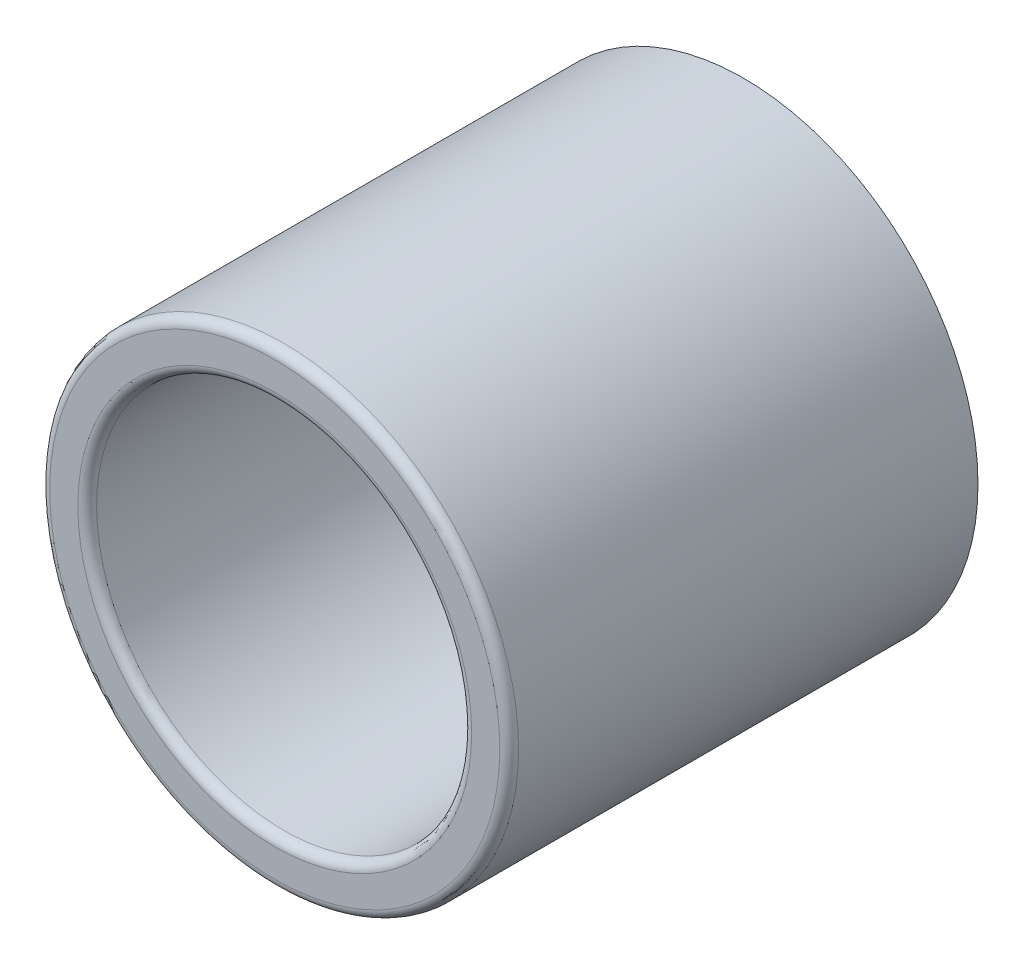
ISO-10303-21;
HEADER;
FILE_DESCRIPTION(('STEP AP214'),'2;1');
FILE_NAME('part.step','',(''),(''),'','','');
FILE_SCHEMA(('AUTOMOTIVE_DESIGN { 1 0 10303 214 1 1 1 1 }'));
ENDSEC;
DATA;
#1=APPLICATION_CONTEXT('core data for automotive mechanical design processes');
#2=APPLICATION_PROTOCOL_DEFINITION('international standard','automotive_design',2000,#1);
#3=PRODUCT_CONTEXT('',#1,'mechanical');
#4=PRODUCT('Part','Part','',(#3));
#5=PRODUCT_RELATED_PRODUCT_CATEGORY('part','',(#4));
#6=PRODUCT_DEFINITION_FORMATION('','',#4);
#7=PRODUCT_DEFINITION_CONTEXT('part definition',#1,'design');
#8=PRODUCT_DEFINITION('design','',#6,#7);
#9=PRODUCT_DEFINITION_SHAPE('','',#8);
#10=(LENGTH_UNIT() NAMED_UNIT(*) SI_UNIT(.MILLI.,.METRE.));
#11=(NAMED_UNIT(*) PLANE_ANGLE_UNIT() SI_UNIT($,.RADIAN.));
#12=(NAMED_UNIT(*) SI_UNIT($,.STERADIAN.) SOLID_ANGLE_UNIT());
#13=UNCERTAINTY_MEASURE_WITH_UNIT(LENGTH_MEASURE(1.E-05),#10,'distance_accuracy_value','');
#14=(GEOMETRIC_REPRESENTATION_CONTEXT(3) GLOBAL_UNCERTAINTY_ASSIGNED_CONTEXT((#13)) GLOBAL_UNIT_ASSIGNED_CONTEXT((#10,
#11,#12)) REPRESENTATION_CONTEXT('',''));
#15=CARTESIAN_POINT('',(0.,0.,0.));
#16=DIRECTION('',(0.,0.,1.));
#17=DIRECTION('',(1.,0.,0.));
#18=AXIS2_PLACEMENT_3D('',#15,#16,#17);
#19=CARTESIAN_POINT('',(0.,0.,5.));
#20=DIRECTION('',(0.,0.,1.));
#21=DIRECTION('',(1.,0.,0.));
#22=AXIS2_PLACEMENT_3D('',#19,#20,#21);
#23=PLANE('',#22);
#24=CARTESIAN_POINT('',(0.,0.,5.));
#25=DIRECTION('',(0.,0.,1.));
#26=DIRECTION('',(1.,0.,0.));
#27=AXIS2_PLACEMENT_3D('',#24,#25,#26);
#28=CIRCLE('',#27,2.1);
#29=CARTESIAN_POINT('',(2.1,0.,5.));
#30=VERTEX_POINT('',#29);
#31=EDGE_CURVE('E42',#30,#30,#28,.F.);
#32=ORIENTED_EDGE('',*,*,#31,.T.);
#33=EDGE_LOOP('',(#32));
#34=FACE_BOUND('',#33,.T.);
#35=CARTESIAN_POINT('',(0.,0.,5.));
#36=DIRECTION('',(0.,0.,1.));
#37=DIRECTION('',(1.,0.,0.));
#38=AXIS2_PLACEMENT_3D('',#35,#36,#37);
#39=CIRCLE('',#38,2.4);
#40=CARTESIAN_POINT('',(2.4,0.,5.));
#41=VERTEX_POINT('',#40);
#42=EDGE_CURVE('E46',#41,#41,#39,.T.);
#43=ORIENTED_EDGE('',*,*,#42,.T.);
#44=EDGE_LOOP('',(#43));
#45=FACE_BOUND('',#44,.T.);
#46=ADVANCED_FACE('F35',(#34,#45),#23,.T.);
#47=CARTESIAN_POINT('',(0.,0.,0.));
#48=DIRECTION('',(0.,0.,1.));
#49=DIRECTION('',(1.,0.,0.));
#50=AXIS2_PLACEMENT_3D('',#47,#48,#49);
#51=PLANE('',#50);
#52=CARTESIAN_POINT('',(0.,0.,0.));
#53=DIRECTION('',(0.,0.,1.));
#54=DIRECTION('',(1.,0.,0.));
#55=AXIS2_PLACEMENT_3D('',#52,#53,#54);
#56=CIRCLE('',#55,2.5);
#57=CARTESIAN_POINT('',(2.5,0.,0.));
#58=VERTEX_POINT('',#57);
#59=EDGE_CURVE('E55',#58,#58,#56,.T.);
#60=ORIENTED_EDGE('',*,*,#59,.F.);
#61=EDGE_LOOP('',(#60));
#62=FACE_BOUND('',#61,.T.);
#63=CARTESIAN_POINT('',(0.,0.,0.));
#64=DIRECTION('',(0.,0.,1.));
#65=DIRECTION('',(1.,0.,0.));
#66=AXIS2_PLACEMENT_3D('',#63,#64,#65);
#67=CIRCLE('',#66,2.);
#68=CARTESIAN_POINT('',(2.,0.,0.));
#69=VERTEX_POINT('',#68);
#70=EDGE_CURVE('E58',#69,#69,#67,.T.);
#71=ORIENTED_EDGE('',*,*,#70,.T.);
#72=EDGE_LOOP('',(#71));
#73=FACE_BOUND('',#72,.T.);
#74=ADVANCED_FACE('F62',(#62,#73),#51,.F.);
#75=CARTESIAN_POINT('',(0.,0.,5.));
#76=DIRECTION('',(0.,0.,-1.));
#77=DIRECTION('',(-1.,0.,0.));
#78=AXIS2_PLACEMENT_3D('',#75,#76,#77);
#79=CYLINDRICAL_SURFACE('',#78,2.5);
#80=CARTESIAN_POINT('',(0.,0.,4.9));
#81=DIRECTION('',(0.,0.,1.));
#82=DIRECTION('',(1.,0.,0.));
#83=AXIS2_PLACEMENT_3D('',#80,#81,#82);
#84=CIRCLE('',#83,2.5);
#85=CARTESIAN_POINT('',(2.5,0.,4.9));
#86=VERTEX_POINT('',#85);
#87=EDGE_CURVE('E10',#86,#86,#84,.F.);
#88=ORIENTED_EDGE('',*,*,#87,.T.);
#89=EDGE_LOOP('',(#88));
#90=FACE_BOUND('',#89,.T.);
#91=ORIENTED_EDGE('',*,*,#59,.T.);
#92=EDGE_LOOP('',(#91));
#93=FACE_BOUND('',#92,.T.);
#94=ADVANCED_FACE('F67',(#90,#93),#79,.T.);
#95=CARTESIAN_POINT('',(0.,0.,5.));
#96=DIRECTION('',(0.,0.,-1.));
#97=DIRECTION('',(-1.,0.,0.));
#98=AXIS2_PLACEMENT_3D('',#95,#96,#97);
#99=CYLINDRICAL_SURFACE('',#98,2.);
#100=CARTESIAN_POINT('',(0.,0.,4.9));
#101=DIRECTION('',(0.,0.,1.));
#102=DIRECTION('',(1.,0.,0.));
#103=AXIS2_PLACEMENT_3D('',#100,#101,#102);
#104=CIRCLE('',#103,2.);
#105=CARTESIAN_POINT('',(2.,0.,4.9));
#106=VERTEX_POINT('',#105);
#107=EDGE_CURVE('E50',#106,#106,#104,.T.);
#108=ORIENTED_EDGE('',*,*,#107,.T.);
#109=EDGE_LOOP('',(#108));
#110=FACE_BOUND('',#109,.T.);
#111=ORIENTED_EDGE('',*,*,#70,.F.);
#112=EDGE_LOOP('',(#111));
#113=FACE_BOUND('',#112,.T.);
#114=ADVANCED_FACE('F64',(#110,#113),#99,.F.);
#115=CARTESIAN_POINT('',(0.,0.,4.9));
#116=DIRECTION('',(0.,0.,1.));
#117=DIRECTION('',(1.,0.,0.));
#118=AXIS2_PLACEMENT_3D('',#115,#116,#117);
#119=TOROIDAL_SURFACE('',#118,2.1,0.1);
#120=ORIENTED_EDGE('',*,*,#31,.F.);
#121=EDGE_LOOP('',(#120));
#122=FACE_BOUND('',#121,.T.);
#123=ORIENTED_EDGE('',*,*,#107,.F.);
#124=EDGE_LOOP('',(#123));
#125=FACE_BOUND('',#124,.T.);
#126=ADVANCED_FACE('F66',(#122,#125),#119,.T.);
#127=CARTESIAN_POINT('',(0.,0.,4.9));
#128=DIRECTION('',(0.,0.,1.));
#129=DIRECTION('',(1.,0.,0.));
#130=AXIS2_PLACEMENT_3D('',#127,#128,#129);
#131=TOROIDAL_SURFACE('',#130,2.4,0.1);
#132=ORIENTED_EDGE('',*,*,#87,.F.);
#133=EDGE_LOOP('',(#132));
#134=FACE_BOUND('',#133,.T.);
#135=ORIENTED_EDGE('',*,*,#42,.F.);
#136=EDGE_LOOP('',(#135));
#137=FACE_BOUND('',#136,.T.);
#138=ADVANCED_FACE('F37',(#134,#137),#131,.T.);
#139=CLOSED_SHELL('',(#46,#74,#94,#114,#126,#138));
#140=MANIFOLD_SOLID_BREP('B2',#139);
#141=ADVANCED_BREP_SHAPE_REPRESENTATION('',(#18,#140),#14);
#142=SHAPE_DEFINITION_REPRESENTATION(#9,#141);
ENDSEC;
END-ISO-10303-21;
